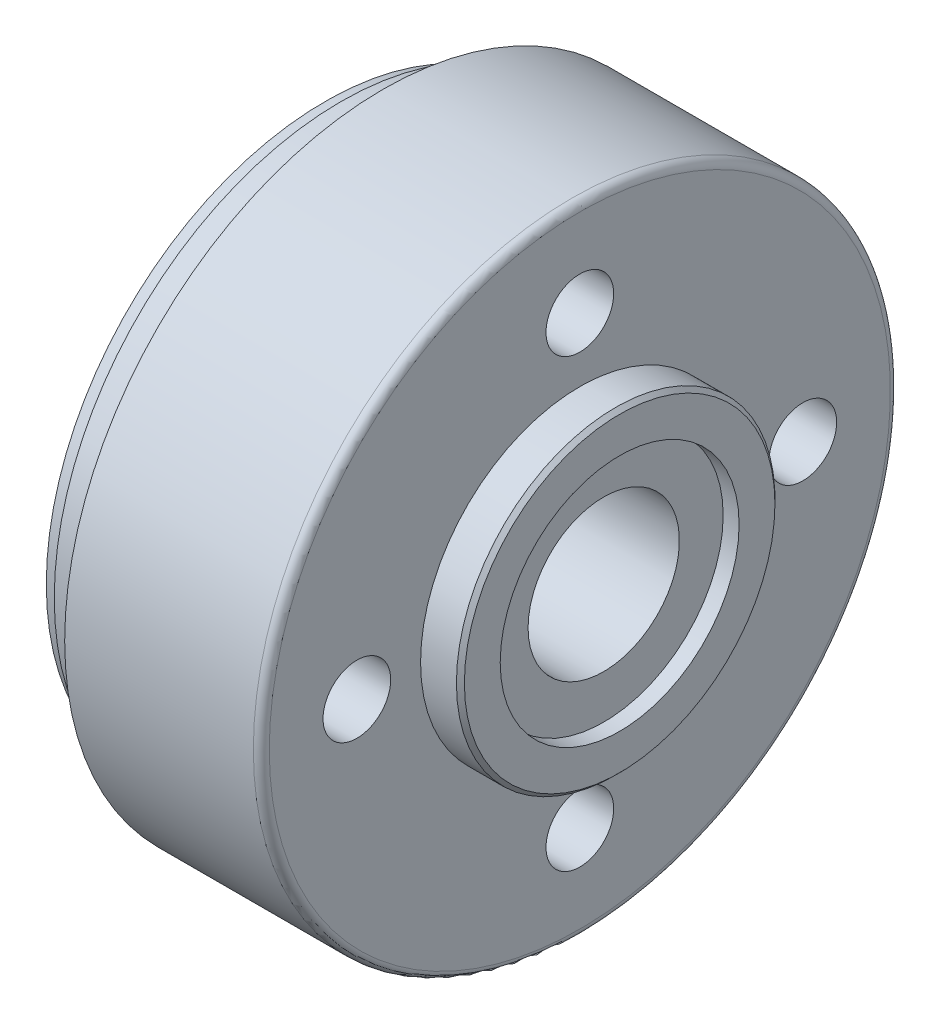
ISO-10303-21;
HEADER;
FILE_DESCRIPTION(('STEP AP214'),'2;1');
FILE_NAME('part.step','',(''),(''),'','','');
FILE_SCHEMA(('AUTOMOTIVE_DESIGN { 1 0 10303 214 1 1 1 1 }'));
ENDSEC;
DATA;
#1=APPLICATION_CONTEXT('core data for automotive mechanical design processes');
#2=APPLICATION_PROTOCOL_DEFINITION('international standard','automotive_design',2000,#1);
#3=PRODUCT_CONTEXT('',#1,'mechanical');
#4=PRODUCT('Part','Part','',(#3));
#5=PRODUCT_RELATED_PRODUCT_CATEGORY('part','',(#4));
#6=PRODUCT_DEFINITION_FORMATION('','',#4);
#7=PRODUCT_DEFINITION_CONTEXT('part definition',#1,'design');
#8=PRODUCT_DEFINITION('design','',#6,#7);
#9=PRODUCT_DEFINITION_SHAPE('','',#8);
#10=(LENGTH_UNIT() NAMED_UNIT(*) SI_UNIT(.MILLI.,.METRE.));
#11=(NAMED_UNIT(*) PLANE_ANGLE_UNIT() SI_UNIT($,.RADIAN.));
#12=(NAMED_UNIT(*) SI_UNIT($,.STERADIAN.) SOLID_ANGLE_UNIT());
#13=UNCERTAINTY_MEASURE_WITH_UNIT(LENGTH_MEASURE(1.E-05),#10,'distance_accuracy_value','');
#14=(GEOMETRIC_REPRESENTATION_CONTEXT(3) GLOBAL_UNCERTAINTY_ASSIGNED_CONTEXT((#13)) GLOBAL_UNIT_ASSIGNED_CONTEXT((#10,
#11,#12)) REPRESENTATION_CONTEXT('',''));
#15=CARTESIAN_POINT('',(0.,0.,0.));
#16=DIRECTION('',(0.,0.,1.));
#17=DIRECTION('',(1.,0.,0.));
#18=AXIS2_PLACEMENT_3D('',#15,#16,#17);
#19=CARTESIAN_POINT('',(0.,35.,0.));
#20=DIRECTION('',(1.,0.,0.));
#21=DIRECTION('',(0.,0.,-1.));
#22=AXIS2_PLACEMENT_3D('',#19,#20,#21);
#23=PLANE('',#22);
#24=CARTESIAN_POINT('',(0.,0.,0.));
#25=DIRECTION('',(-1.,0.,0.));
#26=DIRECTION('',(0.,0.,1.));
#27=AXIS2_PLACEMENT_3D('',#24,#25,#26);
#28=CIRCLE('',#27,9.5);
#29=CARTESIAN_POINT('',(0.,0.,9.5));
#30=VERTEX_POINT('',#29);
#31=EDGE_CURVE('E129',#30,#30,#28,.T.);
#32=ORIENTED_EDGE('',*,*,#31,.F.);
#33=EDGE_LOOP('',(#32));
#34=FACE_BOUND('',#33,.T.);
#35=CARTESIAN_POINT('',(0.,0.,0.));
#36=DIRECTION('',(-1.,0.,0.));
#37=DIRECTION('',(0.,0.,1.));
#38=AXIS2_PLACEMENT_3D('',#35,#36,#37);
#39=CIRCLE('',#38,35.);
#40=CARTESIAN_POINT('',(0.,0.,35.));
#41=VERTEX_POINT('',#40);
#42=EDGE_CURVE('E102',#41,#41,#39,.T.);
#43=ORIENTED_EDGE('',*,*,#42,.T.);
#44=EDGE_LOOP('',(#43));
#45=FACE_BOUND('',#44,.T.);
#46=ADVANCED_FACE('F49',(#34,#45),#23,.F.);
#47=CARTESIAN_POINT('',(-31.2769039735099,0.,0.));
#48=DIRECTION('',(-1.,0.,0.));
#49=DIRECTION('',(0.,0.,1.));
#50=AXIS2_PLACEMENT_3D('',#47,#48,#49);
#51=CYLINDRICAL_SURFACE('',#50,9.5);
#52=CARTESIAN_POINT('',(34.9999999999999,0.,0.));
#53=DIRECTION('',(-1.,0.,0.));
#54=DIRECTION('',(0.,0.,1.));
#55=AXIS2_PLACEMENT_3D('',#52,#53,#54);
#56=CIRCLE('',#55,9.5);
#57=CARTESIAN_POINT('',(34.9999999999999,0.,9.5));
#58=VERTEX_POINT('',#57);
#59=EDGE_CURVE('E126',#58,#58,#56,.T.);
#60=ORIENTED_EDGE('',*,*,#59,.F.);
#61=EDGE_LOOP('',(#60));
#62=FACE_BOUND('',#61,.T.);
#63=ORIENTED_EDGE('',*,*,#31,.T.);
#64=EDGE_LOOP('',(#63));
#65=FACE_BOUND('',#64,.T.);
#66=ADVANCED_FACE('F160',(#62,#65),#51,.F.);
#67=CARTESIAN_POINT('',(34.9999999999999,9.49999999999998,0.));
#68=DIRECTION('',(-1.,0.,0.));
#69=DIRECTION('',(0.,0.,1.));
#70=AXIS2_PLACEMENT_3D('',#67,#68,#69);
#71=PLANE('',#70);
#72=CARTESIAN_POINT('',(34.9999999999999,0.,0.));
#73=DIRECTION('',(-1.,0.,0.));
#74=DIRECTION('',(0.,0.,1.));
#75=AXIS2_PLACEMENT_3D('',#72,#73,#74);
#76=CIRCLE('',#75,15.);
#77=CARTESIAN_POINT('',(34.9999999999999,0.,15.));
#78=VERTEX_POINT('',#77);
#79=EDGE_CURVE('E123',#78,#78,#76,.T.);
#80=ORIENTED_EDGE('',*,*,#79,.F.);
#81=EDGE_LOOP('',(#80));
#82=FACE_BOUND('',#81,.T.);
#83=ORIENTED_EDGE('',*,*,#59,.T.);
#84=EDGE_LOOP('',(#83));
#85=FACE_BOUND('',#84,.T.);
#86=ADVANCED_FACE('F166',(#82,#85),#71,.F.);
#87=CARTESIAN_POINT('',(-31.2769039735099,0.,0.));
#88=DIRECTION('',(-1.,0.,0.));
#89=DIRECTION('',(0.,0.,1.));
#90=AXIS2_PLACEMENT_3D('',#87,#88,#89);
#91=CYLINDRICAL_SURFACE('',#90,15.);
#92=CARTESIAN_POINT('',(36.9999999999999,0.,0.));
#93=DIRECTION('',(-1.,0.,0.));
#94=DIRECTION('',(0.,0.,1.));
#95=AXIS2_PLACEMENT_3D('',#92,#93,#94);
#96=CIRCLE('',#95,15.);
#97=CARTESIAN_POINT('',(36.9999999999999,0.,15.));
#98=VERTEX_POINT('',#97);
#99=EDGE_CURVE('E120',#98,#98,#96,.T.);
#100=ORIENTED_EDGE('',*,*,#99,.F.);
#101=EDGE_LOOP('',(#100));
#102=FACE_BOUND('',#101,.T.);
#103=ORIENTED_EDGE('',*,*,#79,.T.);
#104=EDGE_LOOP('',(#103));
#105=FACE_BOUND('',#104,.T.);
#106=ADVANCED_FACE('F210',(#102,#105),#91,.F.);
#107=CARTESIAN_POINT('',(36.9999999999999,15.,0.));
#108=DIRECTION('',(-1.,0.,0.));
#109=DIRECTION('',(0.,0.,1.));
#110=AXIS2_PLACEMENT_3D('',#107,#108,#109);
#111=PLANE('',#110);
#112=CARTESIAN_POINT('',(36.9999999999999,0.,0.));
#113=DIRECTION('',(-1.,0.,0.));
#114=DIRECTION('',(0.,0.,1.));
#115=AXIS2_PLACEMENT_3D('',#112,#113,#114);
#116=CIRCLE('',#115,19.5);
#117=CARTESIAN_POINT('',(36.9999999999999,0.,19.5));
#118=VERTEX_POINT('',#117);
#119=EDGE_CURVE('E135',#118,#118,#116,.F.);
#120=ORIENTED_EDGE('',*,*,#119,.T.);
#121=EDGE_LOOP('',(#120));
#122=FACE_BOUND('',#121,.T.);
#123=ORIENTED_EDGE('',*,*,#99,.T.);
#124=EDGE_LOOP('',(#123));
#125=FACE_BOUND('',#124,.T.);
#126=ADVANCED_FACE('F206',(#122,#125),#111,.F.);
#127=CARTESIAN_POINT('',(-31.2769039735099,0.,0.));
#128=DIRECTION('',(-1.,0.,0.));
#129=DIRECTION('',(0.,0.,1.));
#130=AXIS2_PLACEMENT_3D('',#127,#128,#129);
#131=CYLINDRICAL_SURFACE('',#130,20.);
#132=CARTESIAN_POINT('',(36.5,0.,0.));
#133=DIRECTION('',(-1.,0.,0.));
#134=DIRECTION('',(0.,0.,1.));
#135=AXIS2_PLACEMENT_3D('',#132,#133,#134);
#136=CIRCLE('',#135,20.);
#137=CARTESIAN_POINT('',(36.5,0.,20.));
#138=VERTEX_POINT('',#137);
#139=EDGE_CURVE('E132',#138,#138,#136,.T.);
#140=ORIENTED_EDGE('',*,*,#139,.T.);
#141=EDGE_LOOP('',(#140));
#142=FACE_BOUND('',#141,.T.);
#143=CARTESIAN_POINT('',(32.,0.,0.));
#144=DIRECTION('',(-1.,0.,0.));
#145=DIRECTION('',(0.,0.,1.));
#146=AXIS2_PLACEMENT_3D('',#143,#144,#145);
#147=CIRCLE('',#146,20.);
#148=CARTESIAN_POINT('',(32.,0.,20.));
#149=VERTEX_POINT('',#148);
#150=EDGE_CURVE('E117',#149,#149,#147,.T.);
#151=ORIENTED_EDGE('',*,*,#150,.F.);
#152=EDGE_LOOP('',(#151));
#153=FACE_BOUND('',#152,.T.);
#154=ADVANCED_FACE('F200',(#142,#153),#131,.T.);
#155=CARTESIAN_POINT('',(32.,20.,0.));
#156=DIRECTION('',(-1.,0.,0.));
#157=DIRECTION('',(0.,0.,1.));
#158=AXIS2_PLACEMENT_3D('',#155,#156,#157);
#159=PLANE('',#158);
#160=CARTESIAN_POINT('',(32.,28.,0.));
#161=DIRECTION('',(1.,0.,0.));
#162=DIRECTION('',(0.,0.,-1.));
#163=AXIS2_PLACEMENT_3D('',#160,#161,#162);
#164=CIRCLE('',#163,4.25);
#165=CARTESIAN_POINT('',(32.,28.,-4.25));
#166=VERTEX_POINT('',#165);
#167=EDGE_CURVE('E80',#166,#166,#164,.T.);
#168=ORIENTED_EDGE('',*,*,#167,.F.);
#169=EDGE_LOOP('',(#168));
#170=FACE_BOUND('',#169,.T.);
#171=CARTESIAN_POINT('',(32.,0.,28.));
#172=DIRECTION('',(1.,0.,0.));
#173=DIRECTION('',(0.,0.,-1.));
#174=AXIS2_PLACEMENT_3D('',#171,#172,#173);
#175=CIRCLE('',#174,4.25);
#176=CARTESIAN_POINT('',(32.,0.,23.75));
#177=VERTEX_POINT('',#176);
#178=EDGE_CURVE('E79',#177,#177,#175,.T.);
#179=ORIENTED_EDGE('',*,*,#178,.F.);
#180=EDGE_LOOP('',(#179));
#181=FACE_BOUND('',#180,.T.);
#182=CARTESIAN_POINT('',(32.0000000000005,-28.,0.));
#183=DIRECTION('',(1.,0.,0.));
#184=DIRECTION('',(0.,0.,-1.));
#185=AXIS2_PLACEMENT_3D('',#182,#183,#184);
#186=CIRCLE('',#185,4.25);
#187=CARTESIAN_POINT('',(32.0000000000005,-28.,-4.25));
#188=VERTEX_POINT('',#187);
#189=EDGE_CURVE('E90',#188,#188,#186,.T.);
#190=ORIENTED_EDGE('',*,*,#189,.F.);
#191=EDGE_LOOP('',(#190));
#192=FACE_BOUND('',#191,.T.);
#193=CARTESIAN_POINT('',(32.0000000000005,0.,-28.));
#194=DIRECTION('',(1.,0.,0.));
#195=DIRECTION('',(0.,0.,-1.));
#196=AXIS2_PLACEMENT_3D('',#193,#194,#195);
#197=CIRCLE('',#196,4.25);
#198=CARTESIAN_POINT('',(32.0000000000005,0.,-32.25));
#199=VERTEX_POINT('',#198);
#200=EDGE_CURVE('E96',#199,#199,#197,.T.);
#201=ORIENTED_EDGE('',*,*,#200,.F.);
#202=EDGE_LOOP('',(#201));
#203=FACE_BOUND('',#202,.T.);
#204=CARTESIAN_POINT('',(32.,0.,0.));
#205=DIRECTION('',(-1.,0.,0.));
#206=DIRECTION('',(0.,0.,1.));
#207=AXIS2_PLACEMENT_3D('',#204,#205,#206);
#208=CIRCLE('',#207,39.);
#209=CARTESIAN_POINT('',(32.,0.,39.));
#210=VERTEX_POINT('',#209);
#211=EDGE_CURVE('E11',#210,#210,#208,.F.);
#212=ORIENTED_EDGE('',*,*,#211,.T.);
#213=EDGE_LOOP('',(#212));
#214=FACE_BOUND('',#213,.T.);
#215=ORIENTED_EDGE('',*,*,#150,.T.);
#216=EDGE_LOOP('',(#215));
#217=FACE_BOUND('',#216,.T.);
#218=ADVANCED_FACE('F195',(#170,#181,#192,#203,#214,#217),#159,.F.);
#219=CARTESIAN_POINT('',(-31.2769039735099,0.,0.));
#220=DIRECTION('',(-1.,0.,0.));
#221=DIRECTION('',(0.,0.,1.));
#222=AXIS2_PLACEMENT_3D('',#219,#220,#221);
#223=CYLINDRICAL_SURFACE('',#222,40.);
#224=CARTESIAN_POINT('',(30.9999999999999,0.,0.));
#225=DIRECTION('',(-1.,0.,0.));
#226=DIRECTION('',(0.,0.,1.));
#227=AXIS2_PLACEMENT_3D('',#224,#225,#226);
#228=CIRCLE('',#227,40.);
#229=CARTESIAN_POINT('',(30.9999999999999,0.,40.));
#230=VERTEX_POINT('',#229);
#231=EDGE_CURVE('E56',#230,#230,#228,.T.);
#232=ORIENTED_EDGE('',*,*,#231,.T.);
#233=EDGE_LOOP('',(#232));
#234=FACE_BOUND('',#233,.T.);
#235=CARTESIAN_POINT('',(7.30940107675848,0.,0.));
#236=DIRECTION('',(-1.,0.,0.));
#237=DIRECTION('',(0.,0.,1.));
#238=AXIS2_PLACEMENT_3D('',#235,#236,#237);
#239=CIRCLE('',#238,40.);
#240=CARTESIAN_POINT('',(7.30940107675848,0.,40.));
#241=VERTEX_POINT('',#240);
#242=EDGE_CURVE('E114',#241,#241,#239,.T.);
#243=ORIENTED_EDGE('',*,*,#242,.F.);
#244=EDGE_LOOP('',(#243));
#245=FACE_BOUND('',#244,.T.);
#246=ADVANCED_FACE('F140',(#234,#245),#223,.T.);
#247=CARTESIAN_POINT('',(7.30940107675848,0.,0.));
#248=DIRECTION('',(1.,0.,0.));
#249=DIRECTION('',(0.,0.,-1.));
#250=AXIS2_PLACEMENT_3D('',#247,#248,#249);
#251=CONICAL_SURFACE('',#250,40.,1.0471975511966);
#252=CARTESIAN_POINT('',(4.99999999999989,0.,0.));
#253=DIRECTION('',(-1.,0.,0.));
#254=DIRECTION('',(0.,0.,1.));
#255=AXIS2_PLACEMENT_3D('',#252,#253,#254);
#256=CIRCLE('',#255,36.);
#257=CARTESIAN_POINT('',(4.99999999999989,0.,36.));
#258=VERTEX_POINT('',#257);
#259=EDGE_CURVE('E111',#258,#258,#256,.T.);
#260=ORIENTED_EDGE('',*,*,#259,.F.);
#261=EDGE_LOOP('',(#260));
#262=FACE_BOUND('',#261,.T.);
#263=ORIENTED_EDGE('',*,*,#242,.T.);
#264=EDGE_LOOP('',(#263));
#265=FACE_BOUND('',#264,.T.);
#266=ADVANCED_FACE('F186',(#262,#265),#251,.T.);
#267=CARTESIAN_POINT('',(-31.2769039735099,0.,0.));
#268=DIRECTION('',(-1.,0.,0.));
#269=DIRECTION('',(0.,0.,1.));
#270=AXIS2_PLACEMENT_3D('',#267,#268,#269);
#271=CYLINDRICAL_SURFACE('',#270,36.);
#272=CARTESIAN_POINT('',(2.,0.,0.));
#273=DIRECTION('',(-1.,0.,0.));
#274=DIRECTION('',(0.,0.,1.));
#275=AXIS2_PLACEMENT_3D('',#272,#273,#274);
#276=CIRCLE('',#275,36.);
#277=CARTESIAN_POINT('',(2.,0.,36.));
#278=VERTEX_POINT('',#277);
#279=EDGE_CURVE('E108',#278,#278,#276,.T.);
#280=ORIENTED_EDGE('',*,*,#279,.F.);
#281=EDGE_LOOP('',(#280));
#282=FACE_BOUND('',#281,.T.);
#283=ORIENTED_EDGE('',*,*,#259,.T.);
#284=EDGE_LOOP('',(#283));
#285=FACE_BOUND('',#284,.T.);
#286=ADVANCED_FACE('F180',(#282,#285),#271,.T.);
#287=CARTESIAN_POINT('',(2.,36.,0.));
#288=DIRECTION('',(1.,0.,0.));
#289=DIRECTION('',(0.,0.,-1.));
#290=AXIS2_PLACEMENT_3D('',#287,#288,#289);
#291=PLANE('',#290);
#292=CARTESIAN_POINT('',(2.,0.,0.));
#293=DIRECTION('',(-1.,0.,0.));
#294=DIRECTION('',(0.,0.,1.));
#295=AXIS2_PLACEMENT_3D('',#292,#293,#294);
#296=CIRCLE('',#295,35.);
#297=CARTESIAN_POINT('',(2.,0.,35.));
#298=VERTEX_POINT('',#297);
#299=EDGE_CURVE('E105',#298,#298,#296,.T.);
#300=ORIENTED_EDGE('',*,*,#299,.F.);
#301=EDGE_LOOP('',(#300));
#302=FACE_BOUND('',#301,.T.);
#303=ORIENTED_EDGE('',*,*,#279,.T.);
#304=EDGE_LOOP('',(#303));
#305=FACE_BOUND('',#304,.T.);
#306=ADVANCED_FACE('F174',(#302,#305),#291,.F.);
#307=CARTESIAN_POINT('',(-31.2769039735099,0.,0.));
#308=DIRECTION('',(-1.,0.,0.));
#309=DIRECTION('',(0.,0.,1.));
#310=AXIS2_PLACEMENT_3D('',#307,#308,#309);
#311=CYLINDRICAL_SURFACE('',#310,35.);
#312=ORIENTED_EDGE('',*,*,#42,.F.);
#313=EDGE_LOOP('',(#312));
#314=FACE_BOUND('',#313,.T.);
#315=ORIENTED_EDGE('',*,*,#299,.T.);
#316=EDGE_LOOP('',(#315));
#317=FACE_BOUND('',#316,.T.);
#318=ADVANCED_FACE('F155',(#314,#317),#311,.T.);
#319=CARTESIAN_POINT('',(36.5,0.,0.));
#320=DIRECTION('',(-1.,0.,0.));
#321=DIRECTION('',(0.,0.,1.));
#322=AXIS2_PLACEMENT_3D('',#319,#320,#321);
#323=CONICAL_SURFACE('',#322,20.,0.785398163397438);
#324=ORIENTED_EDGE('',*,*,#119,.F.);
#325=EDGE_LOOP('',(#324));
#326=FACE_BOUND('',#325,.T.);
#327=ORIENTED_EDGE('',*,*,#139,.F.);
#328=EDGE_LOOP('',(#327));
#329=FACE_BOUND('',#328,.T.);
#330=ADVANCED_FACE('F146',(#326,#329),#323,.T.);
#331=CARTESIAN_POINT('',(30.9999999999999,0.,0.));
#332=DIRECTION('',(-1.,0.,0.));
#333=DIRECTION('',(0.,0.,1.));
#334=AXIS2_PLACEMENT_3D('',#331,#332,#333);
#335=TOROIDAL_SURFACE('',#334,39.,1.);
#336=ORIENTED_EDGE('',*,*,#211,.F.);
#337=EDGE_LOOP('',(#336));
#338=FACE_BOUND('',#337,.T.);
#339=ORIENTED_EDGE('',*,*,#231,.F.);
#340=EDGE_LOOP('',(#339));
#341=FACE_BOUND('',#340,.T.);
#342=ADVANCED_FACE('F143',(#338,#341),#335,.T.);
#343=CARTESIAN_POINT('',(14.5000000000004,0.,-28.));
#344=DIRECTION('',(1.,0.,0.));
#345=DIRECTION('',(0.,0.,-1.));
#346=AXIS2_PLACEMENT_3D('',#343,#344,#345);
#347=CONICAL_SURFACE('',#346,4.25,1.02974425867666);
#348=CARTESIAN_POINT('',(11.9463423691333,0.,-28.));
#349=VERTEX_POINT('',#348);
#350=VERTEX_LOOP('',#349);
#351=FACE_BOUND('',#350,.T.);
#352=CARTESIAN_POINT('',(14.5000000000004,0.,-28.));
#353=DIRECTION('',(1.,0.,0.));
#354=DIRECTION('',(0.,0.,-1.));
#355=AXIS2_PLACEMENT_3D('',#352,#353,#354);
#356=CIRCLE('',#355,4.25);
#357=CARTESIAN_POINT('',(14.5000000000004,0.,-32.25));
#358=VERTEX_POINT('',#357);
#359=EDGE_CURVE('E99',#358,#358,#356,.T.);
#360=ORIENTED_EDGE('',*,*,#359,.T.);
#361=EDGE_LOOP('',(#360));
#362=FACE_BOUND('',#361,.T.);
#363=ADVANCED_FACE('F145',(#351,#362),#347,.F.);
#364=CARTESIAN_POINT('',(32.0000000000005,0.,-28.));
#365=DIRECTION('',(1.,0.,0.));
#366=DIRECTION('',(0.,0.,-1.));
#367=AXIS2_PLACEMENT_3D('',#364,#365,#366);
#368=CYLINDRICAL_SURFACE('',#367,4.25);
#369=ORIENTED_EDGE('',*,*,#359,.F.);
#370=EDGE_LOOP('',(#369));
#371=FACE_BOUND('',#370,.T.);
#372=ORIENTED_EDGE('',*,*,#200,.T.);
#373=EDGE_LOOP('',(#372));
#374=FACE_BOUND('',#373,.T.);
#375=ADVANCED_FACE('F153',(#371,#374),#368,.F.);
#376=CARTESIAN_POINT('',(14.5000000000004,-28.,0.));
#377=DIRECTION('',(1.,0.,0.));
#378=DIRECTION('',(0.,0.,-1.));
#379=AXIS2_PLACEMENT_3D('',#376,#377,#378);
#380=CONICAL_SURFACE('',#379,4.25,1.02974425867666);
#381=CARTESIAN_POINT('',(11.9463423691333,-28.0000000000001,0.));
#382=VERTEX_POINT('',#381);
#383=VERTEX_LOOP('',#382);
#384=FACE_BOUND('',#383,.T.);
#385=CARTESIAN_POINT('',(14.5000000000004,-28.,0.));
#386=DIRECTION('',(1.,0.,0.));
#387=DIRECTION('',(0.,0.,-1.));
#388=AXIS2_PLACEMENT_3D('',#385,#386,#387);
#389=CIRCLE('',#388,4.25);
#390=CARTESIAN_POINT('',(14.5000000000004,-28.,-4.25));
#391=VERTEX_POINT('',#390);
#392=EDGE_CURVE('E93',#391,#391,#389,.T.);
#393=ORIENTED_EDGE('',*,*,#392,.T.);
#394=EDGE_LOOP('',(#393));
#395=FACE_BOUND('',#394,.T.);
#396=ADVANCED_FACE('F279',(#384,#395),#380,.F.);
#397=CARTESIAN_POINT('',(32.0000000000005,-28.,0.));
#398=DIRECTION('',(1.,0.,0.));
#399=DIRECTION('',(0.,0.,-1.));
#400=AXIS2_PLACEMENT_3D('',#397,#398,#399);
#401=CYLINDRICAL_SURFACE('',#400,4.25);
#402=ORIENTED_EDGE('',*,*,#392,.F.);
#403=EDGE_LOOP('',(#402));
#404=FACE_BOUND('',#403,.T.);
#405=ORIENTED_EDGE('',*,*,#189,.T.);
#406=EDGE_LOOP('',(#405));
#407=FACE_BOUND('',#406,.T.);
#408=ADVANCED_FACE('F288',(#404,#407),#401,.F.);
#409=CARTESIAN_POINT('',(14.5,0.,28.));
#410=DIRECTION('',(1.,0.,0.));
#411=DIRECTION('',(0.,0.,-1.));
#412=AXIS2_PLACEMENT_3D('',#409,#410,#411);
#413=CONICAL_SURFACE('',#412,4.25,1.02974425867666);
#414=CARTESIAN_POINT('',(11.9463423691328,0.,28.));
#415=VERTEX_POINT('',#414);
#416=VERTEX_LOOP('',#415);
#417=FACE_BOUND('',#416,.T.);
#418=CARTESIAN_POINT('',(14.5,0.,28.));
#419=DIRECTION('',(1.,0.,0.));
#420=DIRECTION('',(0.,0.,-1.));
#421=AXIS2_PLACEMENT_3D('',#418,#419,#420);
#422=CIRCLE('',#421,4.25);
#423=CARTESIAN_POINT('',(14.5,0.,23.75));
#424=VERTEX_POINT('',#423);
#425=EDGE_CURVE('E83',#424,#424,#422,.T.);
#426=ORIENTED_EDGE('',*,*,#425,.T.);
#427=EDGE_LOOP('',(#426));
#428=FACE_BOUND('',#427,.T.);
#429=ADVANCED_FACE('F296',(#417,#428),#413,.F.);
#430=CARTESIAN_POINT('',(32.,0.,28.));
#431=DIRECTION('',(1.,0.,0.));
#432=DIRECTION('',(0.,0.,-1.));
#433=AXIS2_PLACEMENT_3D('',#430,#431,#432);
#434=CYLINDRICAL_SURFACE('',#433,4.25);
#435=ORIENTED_EDGE('',*,*,#425,.F.);
#436=EDGE_LOOP('',(#435));
#437=FACE_BOUND('',#436,.T.);
#438=ORIENTED_EDGE('',*,*,#178,.T.);
#439=EDGE_LOOP('',(#438));
#440=FACE_BOUND('',#439,.T.);
#441=ADVANCED_FACE('F73',(#437,#440),#434,.F.);
#442=CARTESIAN_POINT('',(14.5,28.,0.));
#443=DIRECTION('',(1.,0.,0.));
#444=DIRECTION('',(0.,0.,-1.));
#445=AXIS2_PLACEMENT_3D('',#442,#443,#444);
#446=CONICAL_SURFACE('',#445,4.25,1.02974425867666);
#447=CARTESIAN_POINT('',(11.9463423691328,27.9999999999999,0.));
#448=VERTEX_POINT('',#447);
#449=VERTEX_LOOP('',#448);
#450=FACE_BOUND('',#449,.T.);
#451=CARTESIAN_POINT('',(14.5,28.,0.));
#452=DIRECTION('',(1.,0.,0.));
#453=DIRECTION('',(0.,0.,-1.));
#454=AXIS2_PLACEMENT_3D('',#451,#452,#453);
#455=CIRCLE('',#454,4.25);
#456=CARTESIAN_POINT('',(14.5,28.,-4.25));
#457=VERTEX_POINT('',#456);
#458=EDGE_CURVE('E77',#457,#457,#455,.T.);
#459=ORIENTED_EDGE('',*,*,#458,.T.);
#460=EDGE_LOOP('',(#459));
#461=FACE_BOUND('',#460,.T.);
#462=ADVANCED_FACE('F69',(#450,#461),#446,.F.);
#463=CARTESIAN_POINT('',(32.,28.,0.));
#464=DIRECTION('',(1.,0.,0.));
#465=DIRECTION('',(0.,0.,-1.));
#466=AXIS2_PLACEMENT_3D('',#463,#464,#465);
#467=CYLINDRICAL_SURFACE('',#466,4.25);
#468=ORIENTED_EDGE('',*,*,#458,.F.);
#469=EDGE_LOOP('',(#468));
#470=FACE_BOUND('',#469,.T.);
#471=ORIENTED_EDGE('',*,*,#167,.T.);
#472=EDGE_LOOP('',(#471));
#473=FACE_BOUND('',#472,.T.);
#474=ADVANCED_FACE('F72',(#470,#473),#467,.F.);
#475=CLOSED_SHELL('',(#46,#66,#86,#106,#126,#154,#218,#246,#266,#286,#306,#318,#330,#342,#363,
#375,#396,#408,#429,#441,#462,#474));
#476=MANIFOLD_SOLID_BREP('B2',#475);
#477=ADVANCED_BREP_SHAPE_REPRESENTATION('',(#18,#476),#14);
#478=SHAPE_DEFINITION_REPRESENTATION(#9,#477);
ENDSEC;
END-ISO-10303-21;
